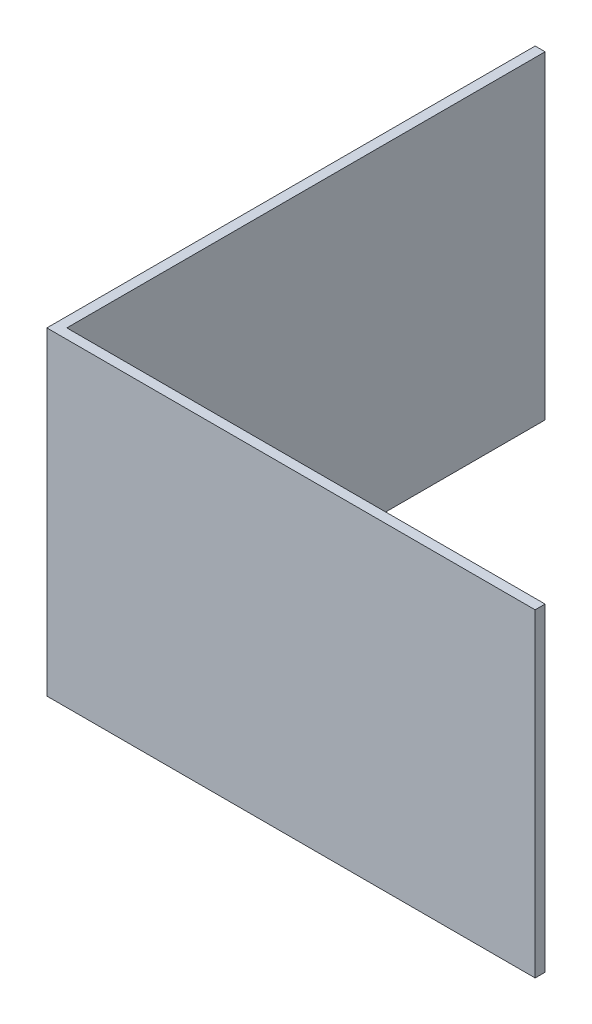
ISO-10303-21;
HEADER;
FILE_DESCRIPTION(('STEP AP214'),'2;1');
FILE_NAME('part.step','',(''),(''),'','','');
FILE_SCHEMA(('AUTOMOTIVE_DESIGN { 1 0 10303 214 1 1 1 1 }'));
ENDSEC;
DATA;
#1=APPLICATION_CONTEXT('core data for automotive mechanical design processes');
#2=APPLICATION_PROTOCOL_DEFINITION('international standard','automotive_design',2000,#1);
#3=PRODUCT_CONTEXT('',#1,'mechanical');
#4=PRODUCT('Part','Part','',(#3));
#5=PRODUCT_RELATED_PRODUCT_CATEGORY('part','',(#4));
#6=PRODUCT_DEFINITION_FORMATION('','',#4);
#7=PRODUCT_DEFINITION_CONTEXT('part definition',#1,'design');
#8=PRODUCT_DEFINITION('design','',#6,#7);
#9=PRODUCT_DEFINITION_SHAPE('','',#8);
#10=(LENGTH_UNIT() NAMED_UNIT(*) SI_UNIT(.MILLI.,.METRE.));
#11=(NAMED_UNIT(*) PLANE_ANGLE_UNIT() SI_UNIT($,.RADIAN.));
#12=(NAMED_UNIT(*) SI_UNIT($,.STERADIAN.) SOLID_ANGLE_UNIT());
#13=UNCERTAINTY_MEASURE_WITH_UNIT(LENGTH_MEASURE(1.E-05),#10,'distance_accuracy_value','');
#14=(GEOMETRIC_REPRESENTATION_CONTEXT(3) GLOBAL_UNCERTAINTY_ASSIGNED_CONTEXT((#13)) GLOBAL_UNIT_ASSIGNED_CONTEXT((#10,
#11,#12)) REPRESENTATION_CONTEXT('',''));
#15=CARTESIAN_POINT('',(0.,0.,0.));
#16=DIRECTION('',(0.,0.,1.));
#17=DIRECTION('',(1.,0.,0.));
#18=AXIS2_PLACEMENT_3D('',#15,#16,#17);
#19=CARTESIAN_POINT('',(-38.89375,50.8,38.89375));
#20=DIRECTION('',(1.,0.,0.));
#21=DIRECTION('',(0.,0.,-1.));
#22=AXIS2_PLACEMENT_3D('',#19,#20,#21);
#23=PLANE('',#22);
#24=DIRECTION('',(0.,0.,1.));
#25=VECTOR('',#24,1.);
#26=CARTESIAN_POINT('',(-38.89375,0.,38.89375));
#27=LINE('',#26,#25);
#28=CARTESIAN_POINT('',(-38.89375,0.,-38.89375));
#29=VERTEX_POINT('',#28);
#30=CARTESIAN_POINT('',(-38.89375,0.,38.89375));
#31=VERTEX_POINT('',#30);
#32=EDGE_CURVE('E132',#29,#31,#27,.T.);
#33=ORIENTED_EDGE('',*,*,#32,.T.);
#34=DIRECTION('',(0.,-1.,0.));
#35=VECTOR('',#34,1.);
#36=CARTESIAN_POINT('',(-38.89375,50.8,38.89375));
#37=LINE('',#36,#35);
#38=CARTESIAN_POINT('',(-38.89375,50.8,38.89375));
#39=VERTEX_POINT('',#38);
#40=EDGE_CURVE('E11',#39,#31,#37,.T.);
#41=ORIENTED_EDGE('',*,*,#40,.F.);
#42=DIRECTION('',(0.,0.,1.));
#43=VECTOR('',#42,1.);
#44=CARTESIAN_POINT('',(-38.89375,50.8,38.89375));
#45=LINE('',#44,#43);
#46=CARTESIAN_POINT('',(-38.89375,50.8,-38.89375));
#47=VERTEX_POINT('',#46);
#48=EDGE_CURVE('E148',#47,#39,#45,.T.);
#49=ORIENTED_EDGE('',*,*,#48,.F.);
#50=DIRECTION('',(0.,-1.,0.));
#51=VECTOR('',#50,1.);
#52=CARTESIAN_POINT('',(-38.89375,50.8,-38.89375));
#53=LINE('',#52,#51);
#54=EDGE_CURVE('E128',#47,#29,#53,.T.);
#55=ORIENTED_EDGE('',*,*,#54,.T.);
#56=EDGE_LOOP('',(#33,#41,#49,#55));
#57=FACE_BOUND('',#56,.T.);
#58=ADVANCED_FACE('F43',(#57),#23,.F.);
#59=CARTESIAN_POINT('',(-38.89375,50.8,38.89375));
#60=DIRECTION('',(0.,0.,-1.));
#61=DIRECTION('',(-1.,0.,0.));
#62=AXIS2_PLACEMENT_3D('',#59,#60,#61);
#63=PLANE('',#62);
#64=DIRECTION('',(1.,0.,0.));
#65=VECTOR('',#64,1.);
#66=CARTESIAN_POINT('',(-38.89375,0.,38.89375));
#67=LINE('',#66,#65);
#68=CARTESIAN_POINT('',(38.89375,0.,38.89375));
#69=VERTEX_POINT('',#68);
#70=EDGE_CURVE('E136',#31,#69,#67,.T.);
#71=ORIENTED_EDGE('',*,*,#70,.T.);
#72=DIRECTION('',(0.,-1.,0.));
#73=VECTOR('',#72,1.);
#74=CARTESIAN_POINT('',(38.89375,50.8,38.89375));
#75=LINE('',#74,#73);
#76=CARTESIAN_POINT('',(38.89375,50.8,38.89375));
#77=VERTEX_POINT('',#76);
#78=EDGE_CURVE('E52',#77,#69,#75,.T.);
#79=ORIENTED_EDGE('',*,*,#78,.F.);
#80=DIRECTION('',(1.,0.,0.));
#81=VECTOR('',#80,1.);
#82=CARTESIAN_POINT('',(-38.89375,50.8,38.89375));
#83=LINE('',#82,#81);
#84=EDGE_CURVE('E97',#39,#77,#83,.T.);
#85=ORIENTED_EDGE('',*,*,#84,.F.);
#86=ORIENTED_EDGE('',*,*,#40,.T.);
#87=EDGE_LOOP('',(#71,#79,#85,#86));
#88=FACE_BOUND('',#87,.T.);
#89=ADVANCED_FACE('F176',(#88),#63,.F.);
#90=CARTESIAN_POINT('',(38.89375,50.8,38.89375));
#91=DIRECTION('',(-1.,0.,0.));
#92=DIRECTION('',(0.,0.,1.));
#93=AXIS2_PLACEMENT_3D('',#90,#91,#92);
#94=PLANE('',#93);
#95=DIRECTION('',(0.,0.,-1.));
#96=VECTOR('',#95,1.);
#97=CARTESIAN_POINT('',(38.89375,0.,38.89375));
#98=LINE('',#97,#96);
#99=CARTESIAN_POINT('',(38.89375,0.,37.30625));
#100=VERTEX_POINT('',#99);
#101=EDGE_CURVE('E139',#69,#100,#98,.T.);
#102=ORIENTED_EDGE('',*,*,#101,.T.);
#103=DIRECTION('',(0.,-1.,0.));
#104=VECTOR('',#103,1.);
#105=CARTESIAN_POINT('',(38.89375,50.8,37.30625));
#106=LINE('',#105,#104);
#107=CARTESIAN_POINT('',(38.89375,50.8,37.30625));
#108=VERTEX_POINT('',#107);
#109=EDGE_CURVE('E121',#108,#100,#106,.T.);
#110=ORIENTED_EDGE('',*,*,#109,.F.);
#111=DIRECTION('',(0.,0.,-1.));
#112=VECTOR('',#111,1.);
#113=CARTESIAN_POINT('',(38.89375,50.8,38.89375));
#114=LINE('',#113,#112);
#115=EDGE_CURVE('E110',#77,#108,#114,.T.);
#116=ORIENTED_EDGE('',*,*,#115,.F.);
#117=ORIENTED_EDGE('',*,*,#78,.T.);
#118=EDGE_LOOP('',(#102,#110,#116,#117));
#119=FACE_BOUND('',#118,.T.);
#120=ADVANCED_FACE('F158',(#119),#94,.F.);
#121=CARTESIAN_POINT('',(38.89375,50.8,37.30625));
#122=DIRECTION('',(0.,0.,1.));
#123=DIRECTION('',(1.,0.,0.));
#124=AXIS2_PLACEMENT_3D('',#121,#122,#123);
#125=PLANE('',#124);
#126=DIRECTION('',(-1.,0.,0.));
#127=VECTOR('',#126,1.);
#128=CARTESIAN_POINT('',(38.89375,0.,37.30625));
#129=LINE('',#128,#127);
#130=CARTESIAN_POINT('',(-37.30625,0.,37.30625));
#131=VERTEX_POINT('',#130);
#132=EDGE_CURVE('E119',#100,#131,#129,.T.);
#133=ORIENTED_EDGE('',*,*,#132,.T.);
#134=DIRECTION('',(0.,-1.,0.));
#135=VECTOR('',#134,1.);
#136=CARTESIAN_POINT('',(-37.30625,50.8,37.30625));
#137=LINE('',#136,#135);
#138=CARTESIAN_POINT('',(-37.30625,50.8,37.30625));
#139=VERTEX_POINT('',#138);
#140=EDGE_CURVE('E116',#139,#131,#137,.T.);
#141=ORIENTED_EDGE('',*,*,#140,.F.);
#142=DIRECTION('',(-1.,0.,0.));
#143=VECTOR('',#142,1.);
#144=CARTESIAN_POINT('',(38.89375,50.8,37.30625));
#145=LINE('',#144,#143);
#146=EDGE_CURVE('E104',#108,#139,#145,.T.);
#147=ORIENTED_EDGE('',*,*,#146,.F.);
#148=ORIENTED_EDGE('',*,*,#109,.T.);
#149=EDGE_LOOP('',(#133,#141,#147,#148));
#150=FACE_BOUND('',#149,.T.);
#151=ADVANCED_FACE('F117',(#150),#125,.F.);
#152=CARTESIAN_POINT('',(-37.30625,50.8,-38.89375));
#153=DIRECTION('',(-1.,0.,0.));
#154=DIRECTION('',(0.,0.,1.));
#155=AXIS2_PLACEMENT_3D('',#152,#153,#154);
#156=PLANE('',#155);
#157=DIRECTION('',(0.,0.,-1.));
#158=VECTOR('',#157,1.);
#159=CARTESIAN_POINT('',(-37.30625,0.,-38.89375));
#160=LINE('',#159,#158);
#161=CARTESIAN_POINT('',(-37.30625,0.,-38.89375));
#162=VERTEX_POINT('',#161);
#163=EDGE_CURVE('E83',#131,#162,#160,.T.);
#164=ORIENTED_EDGE('',*,*,#163,.T.);
#165=DIRECTION('',(0.,-1.,0.));
#166=VECTOR('',#165,1.);
#167=CARTESIAN_POINT('',(-37.30625,50.8,-38.89375));
#168=LINE('',#167,#166);
#169=CARTESIAN_POINT('',(-37.30625,50.8,-38.89375));
#170=VERTEX_POINT('',#169);
#171=EDGE_CURVE('E122',#170,#162,#168,.T.);
#172=ORIENTED_EDGE('',*,*,#171,.F.);
#173=DIRECTION('',(0.,0.,-1.));
#174=VECTOR('',#173,1.);
#175=CARTESIAN_POINT('',(-37.30625,50.8,-38.89375));
#176=LINE('',#175,#174);
#177=EDGE_CURVE('E108',#139,#170,#176,.T.);
#178=ORIENTED_EDGE('',*,*,#177,.F.);
#179=ORIENTED_EDGE('',*,*,#140,.T.);
#180=EDGE_LOOP('',(#164,#172,#178,#179));
#181=FACE_BOUND('',#180,.T.);
#182=ADVANCED_FACE('F124',(#181),#156,.F.);
#183=CARTESIAN_POINT('',(-38.89375,50.8,-38.89375));
#184=DIRECTION('',(0.,0.,1.));
#185=DIRECTION('',(1.,0.,0.));
#186=AXIS2_PLACEMENT_3D('',#183,#184,#185);
#187=PLANE('',#186);
#188=DIRECTION('',(-1.,0.,0.));
#189=VECTOR('',#188,1.);
#190=CARTESIAN_POINT('',(-38.89375,0.,-38.89375));
#191=LINE('',#190,#189);
#192=EDGE_CURVE('E89',#162,#29,#191,.T.);
#193=ORIENTED_EDGE('',*,*,#192,.T.);
#194=ORIENTED_EDGE('',*,*,#54,.F.);
#195=DIRECTION('',(-1.,0.,0.));
#196=VECTOR('',#195,1.);
#197=CARTESIAN_POINT('',(-38.89375,50.8,-38.89375));
#198=LINE('',#197,#196);
#199=EDGE_CURVE('E60',#170,#47,#198,.T.);
#200=ORIENTED_EDGE('',*,*,#199,.F.);
#201=ORIENTED_EDGE('',*,*,#171,.T.);
#202=EDGE_LOOP('',(#193,#194,#200,#201));
#203=FACE_BOUND('',#202,.T.);
#204=ADVANCED_FACE('F165',(#203),#187,.F.);
#205=CARTESIAN_POINT('',(0.,50.8,0.));
#206=DIRECTION('',(0.,-1.,0.));
#207=DIRECTION('',(0.,0.,-1.));
#208=AXIS2_PLACEMENT_3D('',#205,#206,#207);
#209=PLANE('',#208);
#210=ORIENTED_EDGE('',*,*,#48,.T.);
#211=ORIENTED_EDGE('',*,*,#84,.T.);
#212=ORIENTED_EDGE('',*,*,#115,.T.);
#213=ORIENTED_EDGE('',*,*,#146,.T.);
#214=ORIENTED_EDGE('',*,*,#177,.T.);
#215=ORIENTED_EDGE('',*,*,#199,.T.);
#216=EDGE_LOOP('',(#210,#211,#212,#213,#214,#215));
#217=FACE_BOUND('',#216,.T.);
#218=ADVANCED_FACE('F106',(#217),#209,.F.);
#219=CARTESIAN_POINT('',(0.,0.,0.));
#220=DIRECTION('',(0.,-1.,0.));
#221=DIRECTION('',(0.,0.,-1.));
#222=AXIS2_PLACEMENT_3D('',#219,#220,#221);
#223=PLANE('',#222);
#224=ORIENTED_EDGE('',*,*,#32,.F.);
#225=ORIENTED_EDGE('',*,*,#192,.F.);
#226=ORIENTED_EDGE('',*,*,#163,.F.);
#227=ORIENTED_EDGE('',*,*,#132,.F.);
#228=ORIENTED_EDGE('',*,*,#101,.F.);
#229=ORIENTED_EDGE('',*,*,#70,.F.);
#230=EDGE_LOOP('',(#224,#225,#226,#227,#228,#229));
#231=FACE_BOUND('',#230,.T.);
#232=ADVANCED_FACE('F161',(#231),#223,.T.);
#233=CLOSED_SHELL('',(#58,#89,#120,#151,#182,#204,#218,#232));
#234=MANIFOLD_SOLID_BREP('B2',#233);
#235=ADVANCED_BREP_SHAPE_REPRESENTATION('',(#18,#234),#14);
#236=SHAPE_DEFINITION_REPRESENTATION(#9,#235);
ENDSEC;
END-ISO-10303-21;
